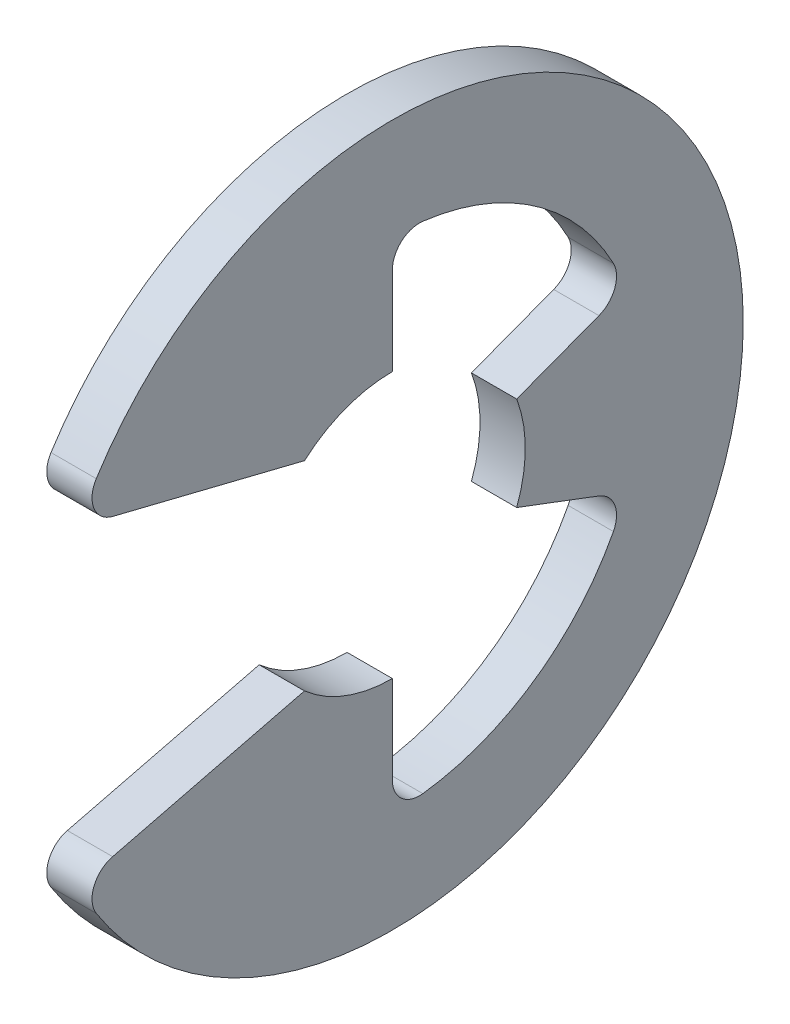
ISO-10303-21;
HEADER;
FILE_DESCRIPTION(('STEP AP214'),'2;1');
FILE_NAME('part.step','',(''),(''),'','','');
FILE_SCHEMA(('AUTOMOTIVE_DESIGN { 1 0 10303 214 1 1 1 1 }'));
ENDSEC;
DATA;
#1=APPLICATION_CONTEXT('core data for automotive mechanical design processes');
#2=APPLICATION_PROTOCOL_DEFINITION('international standard','automotive_design',2000,#1);
#3=PRODUCT_CONTEXT('',#1,'mechanical');
#4=PRODUCT('Part','Part','',(#3));
#5=PRODUCT_RELATED_PRODUCT_CATEGORY('part','',(#4));
#6=PRODUCT_DEFINITION_FORMATION('','',#4);
#7=PRODUCT_DEFINITION_CONTEXT('part definition',#1,'design');
#8=PRODUCT_DEFINITION('design','',#6,#7);
#9=PRODUCT_DEFINITION_SHAPE('','',#8);
#10=(LENGTH_UNIT() NAMED_UNIT(*) SI_UNIT(.MILLI.,.METRE.));
#11=(NAMED_UNIT(*) PLANE_ANGLE_UNIT() SI_UNIT($,.RADIAN.));
#12=(NAMED_UNIT(*) SI_UNIT($,.STERADIAN.) SOLID_ANGLE_UNIT());
#13=UNCERTAINTY_MEASURE_WITH_UNIT(LENGTH_MEASURE(1.E-05),#10,'distance_accuracy_value','');
#14=(GEOMETRIC_REPRESENTATION_CONTEXT(3) GLOBAL_UNCERTAINTY_ASSIGNED_CONTEXT((#13)) GLOBAL_UNIT_ASSIGNED_CONTEXT((#10,
#11,#12)) REPRESENTATION_CONTEXT('',''));
#15=CARTESIAN_POINT('',(0.,0.,0.));
#16=DIRECTION('',(0.,0.,1.));
#17=DIRECTION('',(1.,0.,0.));
#18=AXIS2_PLACEMENT_3D('',#15,#16,#17);
#19=CARTESIAN_POINT('',(0.35,0.,0.));
#20=DIRECTION('',(-1.,0.,0.));
#21=DIRECTION('',(0.,0.,1.));
#22=AXIS2_PLACEMENT_3D('',#19,#20,#21);
#23=CYLINDRICAL_SURFACE('',#22,5.425);
#24=CARTESIAN_POINT('',(0.35,0.,0.));
#25=DIRECTION('',(1.,0.,0.));
#26=DIRECTION('',(0.,0.,-1.));
#27=AXIS2_PLACEMENT_3D('',#24,#25,#26);
#28=CIRCLE('',#27,5.425);
#29=CARTESIAN_POINT('',(0.35,-2.91048609757391,4.57817602062535));
#30=VERTEX_POINT('',#29);
#31=CARTESIAN_POINT('',(0.35,2.91048609757391,4.57817602062535));
#32=VERTEX_POINT('',#31);
#33=EDGE_CURVE('E179',#30,#32,#28,.T.);
#34=ORIENTED_EDGE('',*,*,#33,.F.);
#35=DIRECTION('',(-1.,0.,0.));
#36=VECTOR('',#35,1.);
#37=CARTESIAN_POINT('',(0.35,-2.91048609757391,4.57817602062535));
#38=LINE('',#37,#36);
#39=CARTESIAN_POINT('',(-0.35,-2.91048609757391,4.57817602062535));
#40=VERTEX_POINT('',#39);
#41=EDGE_CURVE('E273',#30,#40,#38,.T.);
#42=ORIENTED_EDGE('',*,*,#41,.T.);
#43=CARTESIAN_POINT('',(-0.35,0.,0.));
#44=DIRECTION('',(1.,0.,0.));
#45=DIRECTION('',(0.,0.,-1.));
#46=AXIS2_PLACEMENT_3D('',#43,#44,#45);
#47=CIRCLE('',#46,5.425);
#48=CARTESIAN_POINT('',(-0.35,2.91048609757391,4.57817602062535));
#49=VERTEX_POINT('',#48);
#50=EDGE_CURVE('E217',#40,#49,#47,.T.);
#51=ORIENTED_EDGE('',*,*,#50,.T.);
#52=DIRECTION('',(-1.,0.,0.));
#53=VECTOR('',#52,1.);
#54=CARTESIAN_POINT('',(0.35,2.91048609757391,4.57817602062535));
#55=LINE('',#54,#53);
#56=EDGE_CURVE('E271',#49,#32,#55,.F.);
#57=ORIENTED_EDGE('',*,*,#56,.T.);
#58=EDGE_LOOP('',(#34,#42,#51,#57));
#59=FACE_BOUND('',#58,.T.);
#60=ADVANCED_FACE('F41',(#59),#23,.T.);
#61=CARTESIAN_POINT('',(0.35,2.41039731260291,4.86010388730495));
#62=DIRECTION('',(0.,0.970536829925373,-0.240952820606874));
#63=DIRECTION('',(0.,0.240952820606874,0.970536829925373));
#64=AXIS2_PLACEMENT_3D('',#61,#62,#63);
#65=PLANE('',#64);
#66=DIRECTION('',(0.,-0.240952820606874,-0.970536829925373));
#67=VECTOR('',#66,1.);
#68=CARTESIAN_POINT('',(0.35,2.41039731260291,4.86010388730495));
#69=LINE('',#68,#67);
#70=CARTESIAN_POINT('',(0.35,2.27753267306405,4.32493677142537));
#71=VERTEX_POINT('',#70);
#72=CARTESIAN_POINT('',(0.35,1.54125,1.35925473605943));
#73=VERTEX_POINT('',#72);
#74=EDGE_CURVE('E165',#71,#73,#69,.T.);
#75=ORIENTED_EDGE('',*,*,#74,.F.);
#76=DIRECTION('',(-1.,0.,0.));
#77=VECTOR('',#76,1.);
#78=CARTESIAN_POINT('',(0.35,2.27753267306405,4.32493677142537));
#79=LINE('',#78,#77);
#80=CARTESIAN_POINT('',(-0.35,2.27753267306405,4.32493677142537));
#81=VERTEX_POINT('',#80);
#82=EDGE_CURVE('E285',#71,#81,#79,.T.);
#83=ORIENTED_EDGE('',*,*,#82,.T.);
#84=DIRECTION('',(0.,-0.240952820606874,-0.970536829925373));
#85=VECTOR('',#84,1.);
#86=CARTESIAN_POINT('',(-0.35,2.41039731260291,4.86010388730495));
#87=LINE('',#86,#85);
#88=CARTESIAN_POINT('',(-0.35,1.54125,1.35925473605943));
#89=VERTEX_POINT('',#88);
#90=EDGE_CURVE('E185',#81,#89,#87,.T.);
#91=ORIENTED_EDGE('',*,*,#90,.T.);
#92=DIRECTION('',(-1.,0.,0.));
#93=VECTOR('',#92,1.);
#94=CARTESIAN_POINT('',(0.35,1.54125,1.35925473605943));
#95=LINE('',#94,#93);
#96=EDGE_CURVE('E182',#73,#89,#95,.T.);
#97=ORIENTED_EDGE('',*,*,#96,.F.);
#98=EDGE_LOOP('',(#75,#83,#91,#97));
#99=FACE_BOUND('',#98,.T.);
#100=ADVANCED_FACE('F183',(#99),#65,.F.);
#101=CARTESIAN_POINT('',(0.35,0.,0.));
#102=DIRECTION('',(-1.,0.,0.));
#103=DIRECTION('',(0.,0.,1.));
#104=AXIS2_PLACEMENT_3D('',#101,#102,#103);
#105=CYLINDRICAL_SURFACE('',#104,2.055);
#106=CARTESIAN_POINT('',(-0.35,0.,0.));
#107=DIRECTION('',(-1.,0.,0.));
#108=DIRECTION('',(0.,0.,1.));
#109=AXIS2_PLACEMENT_3D('',#106,#107,#108);
#110=CIRCLE('',#109,2.055);
#111=CARTESIAN_POINT('',(-0.35,2.055,0.));
#112=VERTEX_POINT('',#111);
#113=EDGE_CURVE('E221',#89,#112,#110,.T.);
#114=ORIENTED_EDGE('',*,*,#113,.T.);
#115=DIRECTION('',(-1.,0.,0.));
#116=VECTOR('',#115,1.);
#117=CARTESIAN_POINT('',(0.35,2.055,0.));
#118=LINE('',#117,#116);
#119=CARTESIAN_POINT('',(0.35,2.055,0.));
#120=VERTEX_POINT('',#119);
#121=EDGE_CURVE('E189',#120,#112,#118,.T.);
#122=ORIENTED_EDGE('',*,*,#121,.F.);
#123=CARTESIAN_POINT('',(0.35,0.,0.));
#124=DIRECTION('',(-1.,0.,0.));
#125=DIRECTION('',(0.,0.,1.));
#126=AXIS2_PLACEMENT_3D('',#123,#124,#125);
#127=CIRCLE('',#126,2.055);
#128=EDGE_CURVE('E171',#73,#120,#127,.T.);
#129=ORIENTED_EDGE('',*,*,#128,.F.);
#130=ORIENTED_EDGE('',*,*,#96,.T.);
#131=EDGE_LOOP('',(#114,#122,#129,#130));
#132=FACE_BOUND('',#131,.T.);
#133=ADVANCED_FACE('F191',(#132),#105,.F.);
#134=CARTESIAN_POINT('',(0.35,2.055,0.));
#135=DIRECTION('',(0.,0.,1.));
#136=DIRECTION('',(0.,-1.,0.));
#137=AXIS2_PLACEMENT_3D('',#134,#135,#136);
#138=PLANE('',#137);
#139=DIRECTION('',(0.,1.,0.));
#140=VECTOR('',#139,1.);
#141=CARTESIAN_POINT('',(-0.35,2.055,0.));
#142=LINE('',#141,#140);
#143=CARTESIAN_POINT('',(-0.35,3.41491421940735,0.));
#144=VERTEX_POINT('',#143);
#145=EDGE_CURVE('E223',#112,#144,#142,.T.);
#146=ORIENTED_EDGE('',*,*,#145,.T.);
#147=DIRECTION('',(1.,0.,0.));
#148=VECTOR('',#147,1.);
#149=CARTESIAN_POINT('',(0.35,3.41491421940735,0.));
#150=LINE('',#149,#148);
#151=CARTESIAN_POINT('',(0.35,3.41491421940735,0.));
#152=VERTEX_POINT('',#151);
#153=EDGE_CURVE('E269',#144,#152,#150,.T.);
#154=ORIENTED_EDGE('',*,*,#153,.T.);
#155=DIRECTION('',(0.,1.,0.));
#156=VECTOR('',#155,1.);
#157=CARTESIAN_POINT('',(0.35,2.055,0.));
#158=LINE('',#157,#156);
#159=EDGE_CURVE('E194',#120,#152,#158,.T.);
#160=ORIENTED_EDGE('',*,*,#159,.F.);
#161=ORIENTED_EDGE('',*,*,#121,.T.);
#162=EDGE_LOOP('',(#146,#154,#160,#161));
#163=FACE_BOUND('',#162,.T.);
#164=ADVANCED_FACE('F393',(#163),#138,.F.);
#165=CARTESIAN_POINT('',(0.35,0.,0.));
#166=DIRECTION('',(-1.,0.,0.));
#167=DIRECTION('',(0.,0.,1.));
#168=AXIS2_PLACEMENT_3D('',#165,#166,#167);
#169=CYLINDRICAL_SURFACE('',#168,3.86064516129032);
#170=CARTESIAN_POINT('',(0.35,0.,0.));
#171=DIRECTION('',(-1.,0.,0.));
#172=DIRECTION('',(0.,0.,-1.));
#173=AXIS2_PLACEMENT_3D('',#170,#171,#172);
#174=CIRCLE('',#173,3.86064516129032);
#175=CARTESIAN_POINT('',(0.35,3.83177324000255,-0.471269454340894));
#176=VERTEX_POINT('',#175);
#177=CARTESIAN_POINT('',(0.35,1.79556862973636,-3.4176767485093));
#178=VERTEX_POINT('',#177);
#179=EDGE_CURVE('E196',#176,#178,#174,.T.);
#180=ORIENTED_EDGE('',*,*,#179,.F.);
#181=DIRECTION('',(-1.,0.,0.));
#182=VECTOR('',#181,1.);
#183=CARTESIAN_POINT('',(0.35,3.83177324000255,-0.471269454340894));
#184=LINE('',#183,#182);
#185=CARTESIAN_POINT('',(-0.35,3.83177324000255,-0.471269454340894));
#186=VERTEX_POINT('',#185);
#187=EDGE_CURVE('E266',#176,#186,#184,.T.);
#188=ORIENTED_EDGE('',*,*,#187,.T.);
#189=CARTESIAN_POINT('',(-0.35,0.,0.));
#190=DIRECTION('',(-1.,0.,0.));
#191=DIRECTION('',(0.,0.,-1.));
#192=AXIS2_PLACEMENT_3D('',#189,#190,#191);
#193=CIRCLE('',#192,3.86064516129032);
#194=CARTESIAN_POINT('',(-0.35,1.79556862973636,-3.4176767485093));
#195=VERTEX_POINT('',#194);
#196=EDGE_CURVE('E226',#186,#195,#193,.T.);
#197=ORIENTED_EDGE('',*,*,#196,.T.);
#198=DIRECTION('',(-1.,0.,0.));
#199=VECTOR('',#198,1.);
#200=CARTESIAN_POINT('',(0.35,1.79556862973636,-3.4176767485093));
#201=LINE('',#200,#199);
#202=EDGE_CURVE('E264',#195,#178,#201,.F.);
#203=ORIENTED_EDGE('',*,*,#202,.T.);
#204=EDGE_LOOP('',(#180,#188,#197,#203));
#205=FACE_BOUND('',#204,.T.);
#206=ADVANCED_FACE('F313',(#205),#169,.F.);
#207=CARTESIAN_POINT('',(0.35,0.726552217669176,-1.92227648245511));
#208=DIRECTION('',(0.,-0.935414346693485,-0.353553390593275));
#209=DIRECTION('',(0.,0.353553390593275,-0.935414346693485));
#210=AXIS2_PLACEMENT_3D('',#207,#208,#209);
#211=PLANE('',#210);
#212=DIRECTION('',(0.,-0.353553390593275,0.935414346693485));
#213=VECTOR('',#212,1.);
#214=CARTESIAN_POINT('',(0.35,0.726552217669176,-1.92227648245511));
#215=LINE('',#214,#213);
#216=CARTESIAN_POINT('',(0.35,1.20735450085665,-3.19435975356122));
#217=VERTEX_POINT('',#216);
#218=CARTESIAN_POINT('',(0.35,0.726552217669177,-1.92227648245511));
#219=VERTEX_POINT('',#218);
#220=EDGE_CURVE('E201',#217,#219,#215,.T.);
#221=ORIENTED_EDGE('',*,*,#220,.F.);
#222=DIRECTION('',(1.,0.,0.));
#223=VECTOR('',#222,1.);
#224=CARTESIAN_POINT('',(-0.35,1.20735450085665,-3.19435975356122));
#225=LINE('',#224,#223);
#226=CARTESIAN_POINT('',(-0.35,1.20735450085665,-3.19435975356122));
#227=VERTEX_POINT('',#226);
#228=EDGE_CURVE('E288',#217,#227,#225,.F.);
#229=ORIENTED_EDGE('',*,*,#228,.T.);
#230=DIRECTION('',(0.,-0.353553390593275,0.935414346693485));
#231=VECTOR('',#230,1.);
#232=CARTESIAN_POINT('',(-0.35,0.726552217669176,-1.92227648245511));
#233=LINE('',#232,#231);
#234=CARTESIAN_POINT('',(-0.35,0.726552217669177,-1.92227648245511));
#235=VERTEX_POINT('',#234);
#236=EDGE_CURVE('E229',#227,#235,#233,.T.);
#237=ORIENTED_EDGE('',*,*,#236,.T.);
#238=DIRECTION('',(-1.,0.,0.));
#239=VECTOR('',#238,1.);
#240=CARTESIAN_POINT('',(0.35,0.726552217669177,-1.92227648245511));
#241=LINE('',#240,#239);
#242=EDGE_CURVE('E253',#219,#235,#241,.T.);
#243=ORIENTED_EDGE('',*,*,#242,.F.);
#244=EDGE_LOOP('',(#221,#229,#237,#243));
#245=FACE_BOUND('',#244,.T.);
#246=ADVANCED_FACE('F316',(#245),#211,.F.);
#247=CARTESIAN_POINT('',(0.35,0.,0.));
#248=DIRECTION('',(-1.,0.,0.));
#249=DIRECTION('',(0.,0.,1.));
#250=AXIS2_PLACEMENT_3D('',#247,#248,#249);
#251=CYLINDRICAL_SURFACE('',#250,2.055);
#252=CARTESIAN_POINT('',(-0.35,0.,0.));
#253=DIRECTION('',(-1.,0.,0.));
#254=DIRECTION('',(0.,0.,1.));
#255=AXIS2_PLACEMENT_3D('',#252,#253,#254);
#256=CIRCLE('',#255,2.055);
#257=CARTESIAN_POINT('',(-0.35,-0.726552217669176,-1.92227648245511));
#258=VERTEX_POINT('',#257);
#259=EDGE_CURVE('E231',#235,#258,#256,.T.);
#260=ORIENTED_EDGE('',*,*,#259,.T.);
#261=DIRECTION('',(-1.,0.,0.));
#262=VECTOR('',#261,1.);
#263=CARTESIAN_POINT('',(0.35,-0.726552217669176,-1.92227648245511));
#264=LINE('',#263,#262);
#265=CARTESIAN_POINT('',(0.35,-0.726552217669176,-1.92227648245511));
#266=VERTEX_POINT('',#265);
#267=EDGE_CURVE('E250',#266,#258,#264,.T.);
#268=ORIENTED_EDGE('',*,*,#267,.F.);
#269=CARTESIAN_POINT('',(0.35,0.,0.));
#270=DIRECTION('',(-1.,0.,0.));
#271=DIRECTION('',(0.,0.,1.));
#272=AXIS2_PLACEMENT_3D('',#269,#270,#271);
#273=CIRCLE('',#272,2.055);
#274=EDGE_CURVE('E203',#219,#266,#273,.T.);
#275=ORIENTED_EDGE('',*,*,#274,.F.);
#276=ORIENTED_EDGE('',*,*,#242,.T.);
#277=EDGE_LOOP('',(#260,#268,#275,#276));
#278=FACE_BOUND('',#277,.T.);
#279=ADVANCED_FACE('F322',(#278),#251,.F.);
#280=CARTESIAN_POINT('',(0.35,-0.726552217669176,-1.92227648245511));
#281=DIRECTION('',(0.,0.935414346693485,-0.353553390593275));
#282=DIRECTION('',(0.,0.353553390593275,0.935414346693485));
#283=AXIS2_PLACEMENT_3D('',#280,#281,#282);
#284=PLANE('',#283);
#285=DIRECTION('',(0.,-0.353553390593275,-0.935414346693485));
#286=VECTOR('',#285,1.);
#287=CARTESIAN_POINT('',(-0.35,-0.726552217669176,-1.92227648245511));
#288=LINE('',#287,#286);
#289=CARTESIAN_POINT('',(-0.35,-1.20735450085665,-3.19435975356122));
#290=VERTEX_POINT('',#289);
#291=EDGE_CURVE('E233',#258,#290,#288,.T.);
#292=ORIENTED_EDGE('',*,*,#291,.T.);
#293=DIRECTION('',(1.,0.,0.));
#294=VECTOR('',#293,1.);
#295=CARTESIAN_POINT('',(0.35,-1.20735450085665,-3.19435975356122));
#296=LINE('',#295,#294);
#297=CARTESIAN_POINT('',(0.35,-1.20735450085665,-3.19435975356122));
#298=VERTEX_POINT('',#297);
#299=EDGE_CURVE('E56',#290,#298,#296,.T.);
#300=ORIENTED_EDGE('',*,*,#299,.T.);
#301=DIRECTION('',(0.,-0.353553390593275,-0.935414346693485));
#302=VECTOR('',#301,1.);
#303=CARTESIAN_POINT('',(0.35,-0.726552217669176,-1.92227648245511));
#304=LINE('',#303,#302);
#305=EDGE_CURVE('E205',#266,#298,#304,.T.);
#306=ORIENTED_EDGE('',*,*,#305,.F.);
#307=ORIENTED_EDGE('',*,*,#267,.T.);
#308=EDGE_LOOP('',(#292,#300,#306,#307));
#309=FACE_BOUND('',#308,.T.);
#310=ADVANCED_FACE('F324',(#309),#284,.F.);
#311=CARTESIAN_POINT('',(0.35,0.,0.));
#312=DIRECTION('',(-1.,0.,0.));
#313=DIRECTION('',(0.,0.,1.));
#314=AXIS2_PLACEMENT_3D('',#311,#312,#313);
#315=CYLINDRICAL_SURFACE('',#314,3.86064516129032);
#316=CARTESIAN_POINT('',(-0.35,0.,0.));
#317=DIRECTION('',(-1.,0.,0.));
#318=DIRECTION('',(0.,0.,-1.));
#319=AXIS2_PLACEMENT_3D('',#316,#317,#318);
#320=CIRCLE('',#319,3.86064516129032);
#321=CARTESIAN_POINT('',(-0.35,-1.79556862973636,-3.4176767485093));
#322=VERTEX_POINT('',#321);
#323=CARTESIAN_POINT('',(-0.35,-3.83177324000255,-0.471269454340895));
#324=VERTEX_POINT('',#323);
#325=EDGE_CURVE('E235',#322,#324,#320,.T.);
#326=ORIENTED_EDGE('',*,*,#325,.T.);
#327=DIRECTION('',(-1.,0.,0.));
#328=VECTOR('',#327,1.);
#329=CARTESIAN_POINT('',(0.35,-3.83177324000255,-0.471269454340895));
#330=LINE('',#329,#328);
#331=CARTESIAN_POINT('',(0.35,-3.83177324000255,-0.471269454340895));
#332=VERTEX_POINT('',#331);
#333=EDGE_CURVE('E262',#324,#332,#330,.F.);
#334=ORIENTED_EDGE('',*,*,#333,.T.);
#335=CARTESIAN_POINT('',(0.35,0.,0.));
#336=DIRECTION('',(-1.,0.,0.));
#337=DIRECTION('',(0.,0.,-1.));
#338=AXIS2_PLACEMENT_3D('',#335,#336,#337);
#339=CIRCLE('',#338,3.86064516129032);
#340=CARTESIAN_POINT('',(0.35,-1.79556862973636,-3.4176767485093));
#341=VERTEX_POINT('',#340);
#342=EDGE_CURVE('E207',#341,#332,#339,.T.);
#343=ORIENTED_EDGE('',*,*,#342,.F.);
#344=DIRECTION('',(-1.,0.,0.));
#345=VECTOR('',#344,1.);
#346=CARTESIAN_POINT('',(0.35,-1.79556862973636,-3.4176767485093));
#347=LINE('',#346,#345);
#348=EDGE_CURVE('E259',#341,#322,#347,.T.);
#349=ORIENTED_EDGE('',*,*,#348,.T.);
#350=EDGE_LOOP('',(#326,#334,#343,#349));
#351=FACE_BOUND('',#350,.T.);
#352=ADVANCED_FACE('F326',(#351),#315,.F.);
#353=CARTESIAN_POINT('',(0.35,-2.055,0.));
#354=DIRECTION('',(0.,0.,1.));
#355=DIRECTION('',(0.,-1.,0.));
#356=AXIS2_PLACEMENT_3D('',#353,#354,#355);
#357=PLANE('',#356);
#358=DIRECTION('',(0.,1.,0.));
#359=VECTOR('',#358,1.);
#360=CARTESIAN_POINT('',(0.35,-2.055,0.));
#361=LINE('',#360,#359);
#362=CARTESIAN_POINT('',(0.35,-3.41491421940735,0.));
#363=VERTEX_POINT('',#362);
#364=CARTESIAN_POINT('',(0.35,-2.055,0.));
#365=VERTEX_POINT('',#364);
#366=EDGE_CURVE('E210',#363,#365,#361,.T.);
#367=ORIENTED_EDGE('',*,*,#366,.F.);
#368=DIRECTION('',(1.,0.,0.));
#369=VECTOR('',#368,1.);
#370=CARTESIAN_POINT('',(-0.35,-3.41491421940735,0.));
#371=LINE('',#370,#369);
#372=CARTESIAN_POINT('',(-0.35,-3.41491421940735,0.));
#373=VERTEX_POINT('',#372);
#374=EDGE_CURVE('E188',#363,#373,#371,.F.);
#375=ORIENTED_EDGE('',*,*,#374,.T.);
#376=DIRECTION('',(0.,1.,0.));
#377=VECTOR('',#376,1.);
#378=CARTESIAN_POINT('',(-0.35,-2.055,0.));
#379=LINE('',#378,#377);
#380=CARTESIAN_POINT('',(-0.35,-2.055,0.));
#381=VERTEX_POINT('',#380);
#382=EDGE_CURVE('E238',#373,#381,#379,.T.);
#383=ORIENTED_EDGE('',*,*,#382,.T.);
#384=DIRECTION('',(-1.,0.,0.));
#385=VECTOR('',#384,1.);
#386=CARTESIAN_POINT('',(0.35,-2.055,0.));
#387=LINE('',#386,#385);
#388=EDGE_CURVE('E247',#365,#381,#387,.T.);
#389=ORIENTED_EDGE('',*,*,#388,.F.);
#390=EDGE_LOOP('',(#367,#375,#383,#389));
#391=FACE_BOUND('',#390,.T.);
#392=ADVANCED_FACE('F332',(#391),#357,.F.);
#393=CARTESIAN_POINT('',(0.35,0.,0.));
#394=DIRECTION('',(-1.,0.,0.));
#395=DIRECTION('',(0.,0.,1.));
#396=AXIS2_PLACEMENT_3D('',#393,#394,#395);
#397=CYLINDRICAL_SURFACE('',#396,2.055);
#398=CARTESIAN_POINT('',(-0.35,0.,0.));
#399=DIRECTION('',(-1.,0.,0.));
#400=DIRECTION('',(0.,0.,-1.));
#401=AXIS2_PLACEMENT_3D('',#398,#399,#400);
#402=CIRCLE('',#401,2.055);
#403=CARTESIAN_POINT('',(-0.35,-1.54125,1.35925473605943));
#404=VERTEX_POINT('',#403);
#405=EDGE_CURVE('E240',#381,#404,#402,.T.);
#406=ORIENTED_EDGE('',*,*,#405,.T.);
#407=DIRECTION('',(-1.,0.,0.));
#408=VECTOR('',#407,1.);
#409=CARTESIAN_POINT('',(0.35,-1.54125,1.35925473605943));
#410=LINE('',#409,#408);
#411=CARTESIAN_POINT('',(0.35,-1.54125,1.35925473605943));
#412=VERTEX_POINT('',#411);
#413=EDGE_CURVE('E216',#412,#404,#410,.T.);
#414=ORIENTED_EDGE('',*,*,#413,.F.);
#415=CARTESIAN_POINT('',(0.35,0.,0.));
#416=DIRECTION('',(-1.,0.,0.));
#417=DIRECTION('',(0.,0.,-1.));
#418=AXIS2_PLACEMENT_3D('',#415,#416,#417);
#419=CIRCLE('',#418,2.055);
#420=EDGE_CURVE('E212',#365,#412,#419,.T.);
#421=ORIENTED_EDGE('',*,*,#420,.F.);
#422=ORIENTED_EDGE('',*,*,#388,.T.);
#423=EDGE_LOOP('',(#406,#414,#421,#422));
#424=FACE_BOUND('',#423,.T.);
#425=ADVANCED_FACE('F383',(#424),#397,.F.);
#426=CARTESIAN_POINT('',(0.35,-2.41039731260291,4.86010388730495));
#427=DIRECTION('',(0.,-0.970536829925373,-0.240952820606874));
#428=DIRECTION('',(0.,0.240952820606874,-0.970536829925373));
#429=AXIS2_PLACEMENT_3D('',#426,#427,#428);
#430=PLANE('',#429);
#431=DIRECTION('',(0.,-0.240952820606874,0.970536829925373));
#432=VECTOR('',#431,1.);
#433=CARTESIAN_POINT('',(-0.35,-2.41039731260291,4.86010388730495));
#434=LINE('',#433,#432);
#435=CARTESIAN_POINT('',(-0.35,-2.27753267306405,4.32493677142537));
#436=VERTEX_POINT('',#435);
#437=EDGE_CURVE('E242',#404,#436,#434,.T.);
#438=ORIENTED_EDGE('',*,*,#437,.T.);
#439=DIRECTION('',(-1.,0.,0.));
#440=VECTOR('',#439,1.);
#441=CARTESIAN_POINT('',(0.35,-2.27753267306405,4.32493677142537));
#442=LINE('',#441,#440);
#443=CARTESIAN_POINT('',(0.35,-2.27753267306405,4.32493677142537));
#444=VERTEX_POINT('',#443);
#445=EDGE_CURVE('E280',#436,#444,#442,.F.);
#446=ORIENTED_EDGE('',*,*,#445,.T.);
#447=DIRECTION('',(0.,-0.240952820606874,0.970536829925373));
#448=VECTOR('',#447,1.);
#449=CARTESIAN_POINT('',(0.35,-2.41039731260291,4.86010388730495));
#450=LINE('',#449,#448);
#451=EDGE_CURVE('E214',#412,#444,#450,.T.);
#452=ORIENTED_EDGE('',*,*,#451,.F.);
#453=ORIENTED_EDGE('',*,*,#413,.T.);
#454=EDGE_LOOP('',(#438,#446,#452,#453));
#455=FACE_BOUND('',#454,.T.);
#456=ADVANCED_FACE('F430',(#455),#430,.F.);
#457=CARTESIAN_POINT('',(0.35,0.,0.));
#458=DIRECTION('',(1.,0.,0.));
#459=DIRECTION('',(0.,0.,-1.));
#460=AXIS2_PLACEMENT_3D('',#457,#458,#459);
#461=PLANE('',#460);
#462=ORIENTED_EDGE('',*,*,#451,.T.);
#463=CARTESIAN_POINT('',(0.35,-2.6851581416327,4.22373658677049));
#464=DIRECTION('',(1.,0.,0.));
#465=DIRECTION('',(0.,0.,-1.));
#466=AXIS2_PLACEMENT_3D('',#463,#464,#465);
#467=CIRCLE('',#466,0.42);
#468=EDGE_CURVE('E283',#444,#30,#467,.T.);
#469=ORIENTED_EDGE('',*,*,#468,.T.);
#470=ORIENTED_EDGE('',*,*,#33,.T.);
#471=CARTESIAN_POINT('',(0.35,2.6851581416327,4.22373658677049));
#472=DIRECTION('',(1.,0.,0.));
#473=DIRECTION('',(0.,0.,-1.));
#474=AXIS2_PLACEMENT_3D('',#471,#472,#473);
#475=CIRCLE('',#474,0.42);
#476=EDGE_CURVE('E175',#32,#71,#475,.T.);
#477=ORIENTED_EDGE('',*,*,#476,.T.);
#478=ORIENTED_EDGE('',*,*,#74,.T.);
#479=ORIENTED_EDGE('',*,*,#128,.T.);
#480=ORIENTED_EDGE('',*,*,#159,.T.);
#481=CARTESIAN_POINT('',(0.35,3.41491421940735,-0.419999999999998));
#482=DIRECTION('',(1.,0.,0.));
#483=DIRECTION('',(0.,0.,-1.));
#484=AXIS2_PLACEMENT_3D('',#481,#482,#483);
#485=CIRCLE('',#484,0.42);
#486=EDGE_CURVE('E297',#152,#176,#485,.F.);
#487=ORIENTED_EDGE('',*,*,#486,.T.);
#488=ORIENTED_EDGE('',*,*,#179,.T.);
#489=CARTESIAN_POINT('',(0.35,1.60022852646792,-3.04586732951205));
#490=DIRECTION('',(1.,0.,0.));
#491=DIRECTION('',(0.,0.,-1.));
#492=AXIS2_PLACEMENT_3D('',#489,#490,#491);
#493=CIRCLE('',#492,0.42);
#494=EDGE_CURVE('E11',#178,#217,#493,.F.);
#495=ORIENTED_EDGE('',*,*,#494,.T.);
#496=ORIENTED_EDGE('',*,*,#220,.T.);
#497=ORIENTED_EDGE('',*,*,#274,.T.);
#498=ORIENTED_EDGE('',*,*,#305,.T.);
#499=CARTESIAN_POINT('',(0.35,-1.60022852646792,-3.04586732951205));
#500=DIRECTION('',(1.,0.,0.));
#501=DIRECTION('',(0.,0.,-1.));
#502=AXIS2_PLACEMENT_3D('',#499,#500,#501);
#503=CIRCLE('',#502,0.42);
#504=EDGE_CURVE('E301',#298,#341,#503,.F.);
#505=ORIENTED_EDGE('',*,*,#504,.T.);
#506=ORIENTED_EDGE('',*,*,#342,.T.);
#507=CARTESIAN_POINT('',(0.35,-3.41491421940735,-0.419999999999999));
#508=DIRECTION('',(1.,0.,0.));
#509=DIRECTION('',(0.,0.,-1.));
#510=AXIS2_PLACEMENT_3D('',#507,#508,#509);
#511=CIRCLE('',#510,0.42);
#512=EDGE_CURVE('E293',#332,#363,#511,.F.);
#513=ORIENTED_EDGE('',*,*,#512,.T.);
#514=ORIENTED_EDGE('',*,*,#366,.T.);
#515=ORIENTED_EDGE('',*,*,#420,.T.);
#516=EDGE_LOOP('',(#462,#469,#470,#477,#478,#479,#480,#487,#488,#495,#496,#497,#498,#505,#506,
#513,#514,#515));
#517=FACE_BOUND('',#516,.T.);
#518=ADVANCED_FACE('F168',(#517),#461,.T.);
#519=CARTESIAN_POINT('',(-0.35,0.,0.));
#520=DIRECTION('',(1.,0.,0.));
#521=DIRECTION('',(0.,0.,-1.));
#522=AXIS2_PLACEMENT_3D('',#519,#520,#521);
#523=PLANE('',#522);
#524=ORIENTED_EDGE('',*,*,#50,.F.);
#525=CARTESIAN_POINT('',(-0.35,-2.6851581416327,4.22373658677049));
#526=DIRECTION('',(1.,0.,0.));
#527=DIRECTION('',(0.,0.,-1.));
#528=AXIS2_PLACEMENT_3D('',#525,#526,#527);
#529=CIRCLE('',#528,0.42);
#530=EDGE_CURVE('E278',#40,#436,#529,.F.);
#531=ORIENTED_EDGE('',*,*,#530,.T.);
#532=ORIENTED_EDGE('',*,*,#437,.F.);
#533=ORIENTED_EDGE('',*,*,#405,.F.);
#534=ORIENTED_EDGE('',*,*,#382,.F.);
#535=CARTESIAN_POINT('',(-0.35,-3.41491421940735,-0.419999999999999));
#536=DIRECTION('',(1.,0.,0.));
#537=DIRECTION('',(0.,0.,-1.));
#538=AXIS2_PLACEMENT_3D('',#535,#536,#537);
#539=CIRCLE('',#538,0.42);
#540=EDGE_CURVE('E291',#373,#324,#539,.T.);
#541=ORIENTED_EDGE('',*,*,#540,.T.);
#542=ORIENTED_EDGE('',*,*,#325,.F.);
#543=CARTESIAN_POINT('',(-0.35,-1.60022852646792,-3.04586732951205));
#544=DIRECTION('',(1.,0.,0.));
#545=DIRECTION('',(0.,0.,-1.));
#546=AXIS2_PLACEMENT_3D('',#543,#544,#545);
#547=CIRCLE('',#546,0.42);
#548=EDGE_CURVE('E299',#322,#290,#547,.T.);
#549=ORIENTED_EDGE('',*,*,#548,.T.);
#550=ORIENTED_EDGE('',*,*,#291,.F.);
#551=ORIENTED_EDGE('',*,*,#259,.F.);
#552=ORIENTED_EDGE('',*,*,#236,.F.);
#553=CARTESIAN_POINT('',(-0.35,1.60022852646792,-3.04586732951205));
#554=DIRECTION('',(1.,0.,0.));
#555=DIRECTION('',(0.,0.,-1.));
#556=AXIS2_PLACEMENT_3D('',#553,#554,#555);
#557=CIRCLE('',#556,0.42);
#558=EDGE_CURVE('E49',#227,#195,#557,.T.);
#559=ORIENTED_EDGE('',*,*,#558,.T.);
#560=ORIENTED_EDGE('',*,*,#196,.F.);
#561=CARTESIAN_POINT('',(-0.35,3.41491421940735,-0.419999999999998));
#562=DIRECTION('',(1.,0.,0.));
#563=DIRECTION('',(0.,0.,-1.));
#564=AXIS2_PLACEMENT_3D('',#561,#562,#563);
#565=CIRCLE('',#564,0.42);
#566=EDGE_CURVE('E295',#186,#144,#565,.T.);
#567=ORIENTED_EDGE('',*,*,#566,.T.);
#568=ORIENTED_EDGE('',*,*,#145,.F.);
#569=ORIENTED_EDGE('',*,*,#113,.F.);
#570=ORIENTED_EDGE('',*,*,#90,.F.);
#571=CARTESIAN_POINT('',(-0.35,2.6851581416327,4.22373658677049));
#572=DIRECTION('',(1.,0.,0.));
#573=DIRECTION('',(0.,0.,-1.));
#574=AXIS2_PLACEMENT_3D('',#571,#572,#573);
#575=CIRCLE('',#574,0.42);
#576=EDGE_CURVE('E276',#81,#49,#575,.F.);
#577=ORIENTED_EDGE('',*,*,#576,.T.);
#578=EDGE_LOOP('',(#524,#531,#532,#533,#534,#541,#542,#549,#550,#551,#552,#559,#560,#567,#568,
#569,#570,#577));
#579=FACE_BOUND('',#578,.T.);
#580=ADVANCED_FACE('F306',(#579),#523,.F.);
#581=CARTESIAN_POINT('',(0.35,-3.41491421940735,-0.419999999999999));
#582=DIRECTION('',(-1.,0.,0.));
#583=DIRECTION('',(0.,0.,1.));
#584=AXIS2_PLACEMENT_3D('',#581,#582,#583);
#585=CYLINDRICAL_SURFACE('',#584,0.42);
#586=ORIENTED_EDGE('',*,*,#512,.F.);
#587=ORIENTED_EDGE('',*,*,#333,.F.);
#588=ORIENTED_EDGE('',*,*,#540,.F.);
#589=ORIENTED_EDGE('',*,*,#374,.F.);
#590=EDGE_LOOP('',(#586,#587,#588,#589));
#591=FACE_BOUND('',#590,.T.);
#592=ADVANCED_FACE('F348',(#591),#585,.F.);
#593=CARTESIAN_POINT('',(0.35,3.41491421940735,-0.419999999999998));
#594=DIRECTION('',(-1.,0.,0.));
#595=DIRECTION('',(0.,0.,1.));
#596=AXIS2_PLACEMENT_3D('',#593,#594,#595);
#597=CYLINDRICAL_SURFACE('',#596,0.42);
#598=ORIENTED_EDGE('',*,*,#486,.F.);
#599=ORIENTED_EDGE('',*,*,#153,.F.);
#600=ORIENTED_EDGE('',*,*,#566,.F.);
#601=ORIENTED_EDGE('',*,*,#187,.F.);
#602=EDGE_LOOP('',(#598,#599,#600,#601));
#603=FACE_BOUND('',#602,.T.);
#604=ADVANCED_FACE('F351',(#603),#597,.F.);
#605=CARTESIAN_POINT('',(0.35,-2.6851581416327,4.22373658677049));
#606=DIRECTION('',(-1.,0.,0.));
#607=DIRECTION('',(0.,0.,1.));
#608=AXIS2_PLACEMENT_3D('',#605,#606,#607);
#609=CYLINDRICAL_SURFACE('',#608,0.42);
#610=ORIENTED_EDGE('',*,*,#468,.F.);
#611=ORIENTED_EDGE('',*,*,#445,.F.);
#612=ORIENTED_EDGE('',*,*,#530,.F.);
#613=ORIENTED_EDGE('',*,*,#41,.F.);
#614=EDGE_LOOP('',(#610,#611,#612,#613));
#615=FACE_BOUND('',#614,.T.);
#616=ADVANCED_FACE('F355',(#615),#609,.T.);
#617=CARTESIAN_POINT('',(0.35,2.6851581416327,4.22373658677049));
#618=DIRECTION('',(-1.,0.,0.));
#619=DIRECTION('',(0.,0.,1.));
#620=AXIS2_PLACEMENT_3D('',#617,#618,#619);
#621=CYLINDRICAL_SURFACE('',#620,0.42);
#622=ORIENTED_EDGE('',*,*,#476,.F.);
#623=ORIENTED_EDGE('',*,*,#56,.F.);
#624=ORIENTED_EDGE('',*,*,#576,.F.);
#625=ORIENTED_EDGE('',*,*,#82,.F.);
#626=EDGE_LOOP('',(#622,#623,#624,#625));
#627=FACE_BOUND('',#626,.T.);
#628=ADVANCED_FACE('F359',(#627),#621,.T.);
#629=CARTESIAN_POINT('',(0.35,-1.60022852646792,-3.04586732951205));
#630=DIRECTION('',(-1.,0.,0.));
#631=DIRECTION('',(0.,0.,1.));
#632=AXIS2_PLACEMENT_3D('',#629,#630,#631);
#633=CYLINDRICAL_SURFACE('',#632,0.42);
#634=ORIENTED_EDGE('',*,*,#504,.F.);
#635=ORIENTED_EDGE('',*,*,#299,.F.);
#636=ORIENTED_EDGE('',*,*,#548,.F.);
#637=ORIENTED_EDGE('',*,*,#348,.F.);
#638=EDGE_LOOP('',(#634,#635,#636,#637));
#639=FACE_BOUND('',#638,.T.);
#640=ADVANCED_FACE('F362',(#639),#633,.F.);
#641=CARTESIAN_POINT('',(0.35,1.60022852646792,-3.04586732951205));
#642=DIRECTION('',(-1.,0.,0.));
#643=DIRECTION('',(0.,0.,1.));
#644=AXIS2_PLACEMENT_3D('',#641,#642,#643);
#645=CYLINDRICAL_SURFACE('',#644,0.42);
#646=ORIENTED_EDGE('',*,*,#494,.F.);
#647=ORIENTED_EDGE('',*,*,#202,.F.);
#648=ORIENTED_EDGE('',*,*,#558,.F.);
#649=ORIENTED_EDGE('',*,*,#228,.F.);
#650=EDGE_LOOP('',(#646,#647,#648,#649));
#651=FACE_BOUND('',#650,.T.);
#652=ADVANCED_FACE('F43',(#651),#645,.F.);
#653=CLOSED_SHELL('',(#60,#100,#133,#164,#206,#246,#279,#310,#352,#392,#425,#456,#518,#580,#592,
#604,#616,#628,#640,#652));
#654=MANIFOLD_SOLID_BREP('B2',#653);
#655=ADVANCED_BREP_SHAPE_REPRESENTATION('',(#18,#654),#14);
#656=SHAPE_DEFINITION_REPRESENTATION(#9,#655);
ENDSEC;
END-ISO-10303-21;
